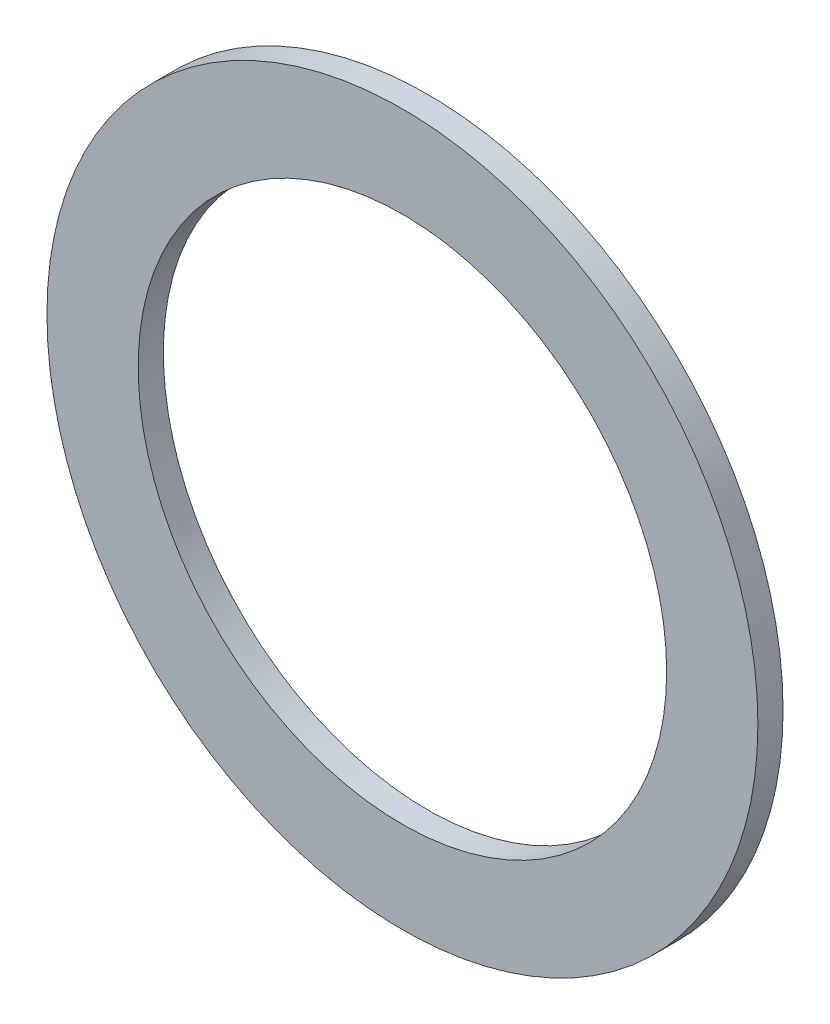
ISO-10303-21;
HEADER;
FILE_DESCRIPTION(('STEP AP214'),'2;1');
FILE_NAME('part.step','',(''),(''),'','','');
FILE_SCHEMA(('AUTOMOTIVE_DESIGN { 1 0 10303 214 1 1 1 1 }'));
ENDSEC;
DATA;
#1=APPLICATION_CONTEXT('core data for automotive mechanical design processes');
#2=APPLICATION_PROTOCOL_DEFINITION('international standard','automotive_design',2000,#1);
#3=PRODUCT_CONTEXT('',#1,'mechanical');
#4=PRODUCT('Part','Part','',(#3));
#5=PRODUCT_RELATED_PRODUCT_CATEGORY('part','',(#4));
#6=PRODUCT_DEFINITION_FORMATION('','',#4);
#7=PRODUCT_DEFINITION_CONTEXT('part definition',#1,'design');
#8=PRODUCT_DEFINITION('design','',#6,#7);
#9=PRODUCT_DEFINITION_SHAPE('','',#8);
#10=(LENGTH_UNIT() NAMED_UNIT(*) SI_UNIT(.MILLI.,.METRE.));
#11=(NAMED_UNIT(*) PLANE_ANGLE_UNIT() SI_UNIT($,.RADIAN.));
#12=(NAMED_UNIT(*) SI_UNIT($,.STERADIAN.) SOLID_ANGLE_UNIT());
#13=UNCERTAINTY_MEASURE_WITH_UNIT(LENGTH_MEASURE(1.E-05),#10,'distance_accuracy_value','');
#14=(GEOMETRIC_REPRESENTATION_CONTEXT(3) GLOBAL_UNCERTAINTY_ASSIGNED_CONTEXT((#13)) GLOBAL_UNIT_ASSIGNED_CONTEXT((#10,
#11,#12)) REPRESENTATION_CONTEXT('',''));
#15=CARTESIAN_POINT('',(0.,0.,0.));
#16=DIRECTION('',(0.,0.,1.));
#17=DIRECTION('',(1.,0.,0.));
#18=AXIS2_PLACEMENT_3D('',#15,#16,#17);
#19=CARTESIAN_POINT('',(0.,0.,1.016));
#20=DIRECTION('',(0.,0.,1.));
#21=DIRECTION('',(1.,0.,0.));
#22=AXIS2_PLACEMENT_3D('',#19,#20,#21);
#23=PLANE('',#22);
#24=CARTESIAN_POINT('',(0.,0.,1.016));
#25=DIRECTION('',(0.,0.,1.));
#26=DIRECTION('',(1.,0.,0.));
#27=AXIS2_PLACEMENT_3D('',#24,#25,#26);
#28=CIRCLE('',#27,14.351);
#29=CARTESIAN_POINT('',(14.351,0.,1.016));
#30=VERTEX_POINT('',#29);
#31=EDGE_CURVE('E10',#30,#30,#28,.T.);
#32=ORIENTED_EDGE('',*,*,#31,.T.);
#33=EDGE_LOOP('',(#32));
#34=FACE_BOUND('',#33,.T.);
#35=CARTESIAN_POINT('',(0.,0.,1.016));
#36=DIRECTION('',(0.,0.,1.));
#37=DIRECTION('',(1.,0.,0.));
#38=AXIS2_PLACEMENT_3D('',#35,#36,#37);
#39=CIRCLE('',#38,10.668);
#40=CARTESIAN_POINT('',(10.668,0.,1.016));
#41=VERTEX_POINT('',#40);
#42=EDGE_CURVE('E52',#41,#41,#39,.T.);
#43=ORIENTED_EDGE('',*,*,#42,.F.);
#44=EDGE_LOOP('',(#43));
#45=FACE_BOUND('',#44,.T.);
#46=ADVANCED_FACE('F41',(#34,#45),#23,.T.);
#47=CARTESIAN_POINT('',(0.,0.,0.));
#48=DIRECTION('',(0.,0.,1.));
#49=DIRECTION('',(1.,0.,0.));
#50=AXIS2_PLACEMENT_3D('',#47,#48,#49);
#51=PLANE('',#50);
#52=CARTESIAN_POINT('',(0.,0.,0.));
#53=DIRECTION('',(0.,0.,1.));
#54=DIRECTION('',(1.,0.,0.));
#55=AXIS2_PLACEMENT_3D('',#52,#53,#54);
#56=CIRCLE('',#55,14.351);
#57=CARTESIAN_POINT('',(14.351,0.,0.));
#58=VERTEX_POINT('',#57);
#59=EDGE_CURVE('E45',#58,#58,#56,.T.);
#60=ORIENTED_EDGE('',*,*,#59,.F.);
#61=EDGE_LOOP('',(#60));
#62=FACE_BOUND('',#61,.T.);
#63=CARTESIAN_POINT('',(0.,0.,0.));
#64=DIRECTION('',(0.,0.,1.));
#65=DIRECTION('',(1.,0.,0.));
#66=AXIS2_PLACEMENT_3D('',#63,#64,#65);
#67=CIRCLE('',#66,10.668);
#68=CARTESIAN_POINT('',(10.668,0.,0.));
#69=VERTEX_POINT('',#68);
#70=EDGE_CURVE('E54',#69,#69,#67,.T.);
#71=ORIENTED_EDGE('',*,*,#70,.T.);
#72=EDGE_LOOP('',(#71));
#73=FACE_BOUND('',#72,.T.);
#74=ADVANCED_FACE('F64',(#62,#73),#51,.F.);
#75=CARTESIAN_POINT('',(0.,0.,1.016));
#76=DIRECTION('',(0.,0.,-1.));
#77=DIRECTION('',(-1.,0.,0.));
#78=AXIS2_PLACEMENT_3D('',#75,#76,#77);
#79=CYLINDRICAL_SURFACE('',#78,14.351);
#80=ORIENTED_EDGE('',*,*,#31,.F.);
#81=EDGE_LOOP('',(#80));
#82=FACE_BOUND('',#81,.T.);
#83=ORIENTED_EDGE('',*,*,#59,.T.);
#84=EDGE_LOOP('',(#83));
#85=FACE_BOUND('',#84,.T.);
#86=ADVANCED_FACE('F43',(#82,#85),#79,.T.);
#87=CARTESIAN_POINT('',(0.,0.,1.016));
#88=DIRECTION('',(0.,0.,-1.));
#89=DIRECTION('',(-1.,0.,0.));
#90=AXIS2_PLACEMENT_3D('',#87,#88,#89);
#91=CYLINDRICAL_SURFACE('',#90,10.668);
#92=ORIENTED_EDGE('',*,*,#42,.T.);
#93=EDGE_LOOP('',(#92));
#94=FACE_BOUND('',#93,.T.);
#95=ORIENTED_EDGE('',*,*,#70,.F.);
#96=EDGE_LOOP('',(#95));
#97=FACE_BOUND('',#96,.T.);
#98=ADVANCED_FACE('F60',(#94,#97),#91,.F.);
#99=CLOSED_SHELL('',(#46,#74,#86,#98));
#100=MANIFOLD_SOLID_BREP('B2',#99);
#101=ADVANCED_BREP_SHAPE_REPRESENTATION('',(#18,#100),#14);
#102=SHAPE_DEFINITION_REPRESENTATION(#9,#101);
ENDSEC;
END-ISO-10303-21;
